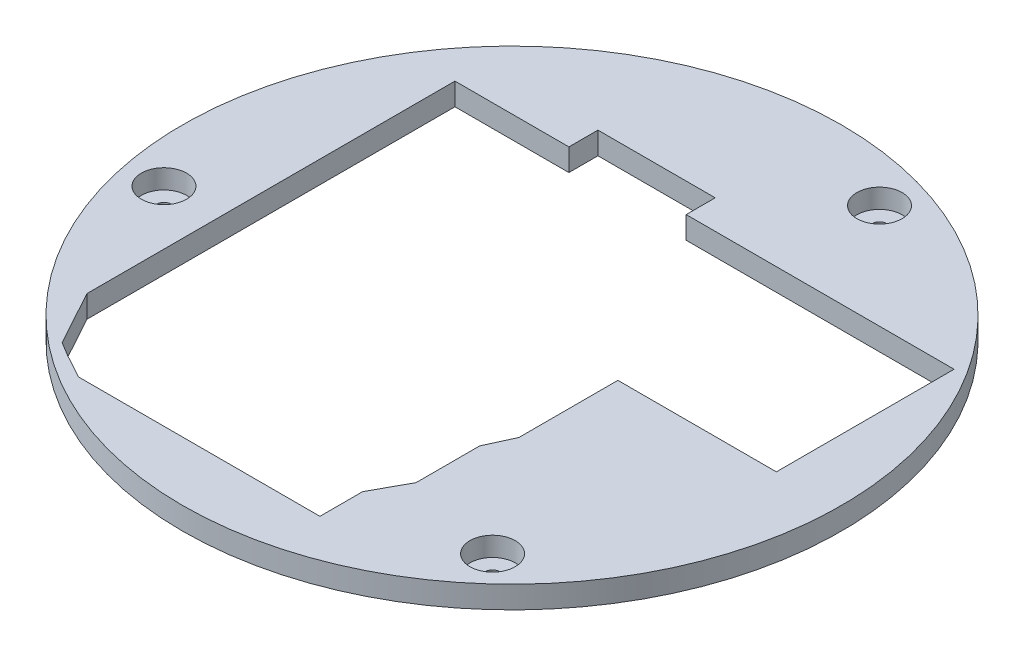
ISO-10303-21;
HEADER;
FILE_DESCRIPTION(('STEP AP214'),'2;1');
FILE_NAME('part.step','',(''),(''),'','','');
FILE_SCHEMA(('AUTOMOTIVE_DESIGN { 1 0 10303 214 1 1 1 1 }'));
ENDSEC;
DATA;
#1=APPLICATION_CONTEXT('core data for automotive mechanical design processes');
#2=APPLICATION_PROTOCOL_DEFINITION('international standard','automotive_design',2000,#1);
#3=PRODUCT_CONTEXT('',#1,'mechanical');
#4=PRODUCT('Part','Part','',(#3));
#5=PRODUCT_RELATED_PRODUCT_CATEGORY('part','',(#4));
#6=PRODUCT_DEFINITION_FORMATION('','',#4);
#7=PRODUCT_DEFINITION_CONTEXT('part definition',#1,'design');
#8=PRODUCT_DEFINITION('design','',#6,#7);
#9=PRODUCT_DEFINITION_SHAPE('','',#8);
#10=(LENGTH_UNIT() NAMED_UNIT(*) SI_UNIT(.MILLI.,.METRE.));
#11=(NAMED_UNIT(*) PLANE_ANGLE_UNIT() SI_UNIT($,.RADIAN.));
#12=(NAMED_UNIT(*) SI_UNIT($,.STERADIAN.) SOLID_ANGLE_UNIT());
#13=UNCERTAINTY_MEASURE_WITH_UNIT(LENGTH_MEASURE(1.E-05),#10,'distance_accuracy_value','');
#14=(GEOMETRIC_REPRESENTATION_CONTEXT(3) GLOBAL_UNCERTAINTY_ASSIGNED_CONTEXT((#13)) GLOBAL_UNIT_ASSIGNED_CONTEXT((#10,
#11,#12)) REPRESENTATION_CONTEXT('',''));
#15=CARTESIAN_POINT('',(0.,0.,0.));
#16=DIRECTION('',(0.,0.,1.));
#17=DIRECTION('',(1.,0.,0.));
#18=AXIS2_PLACEMENT_3D('',#15,#16,#17);
#19=CARTESIAN_POINT('',(5.84466803456712,3.,0.));
#20=DIRECTION('',(0.,1.,0.));
#21=DIRECTION('',(0.,0.,1.));
#22=AXIS2_PLACEMENT_3D('',#19,#20,#21);
#23=PLANE('',#22);
#24=CARTESIAN_POINT('',(17.8189250962218,3.,-37.5363446251951));
#25=DIRECTION('',(0.,1.,0.));
#26=DIRECTION('',(0.,0.,1.));
#27=AXIS2_PLACEMENT_3D('',#24,#25,#26);
#28=CIRCLE('',#27,3.05);
#29=CARTESIAN_POINT('',(17.8189250962218,3.,-34.4863446251951));
#30=VERTEX_POINT('',#29);
#31=EDGE_CURVE('E764',#30,#30,#28,.T.);
#32=ORIENTED_EDGE('',*,*,#31,.F.);
#33=EDGE_LOOP('',(#32));
#34=FACE_BOUND('',#33,.T.);
#35=CARTESIAN_POINT('',(32.3649675143661,3.,29.1381831194358));
#36=DIRECTION('',(0.,1.,0.));
#37=DIRECTION('',(0.,0.,1.));
#38=AXIS2_PLACEMENT_3D('',#35,#36,#37);
#39=CIRCLE('',#38,3.05);
#40=CARTESIAN_POINT('',(32.3649675143661,3.,32.1881831194358));
#41=VERTEX_POINT('',#40);
#42=EDGE_CURVE('E768',#41,#41,#39,.T.);
#43=ORIENTED_EDGE('',*,*,#42,.F.);
#44=EDGE_LOOP('',(#43));
#45=FACE_BOUND('',#44,.T.);
#46=CARTESIAN_POINT('',(-32.6498885068867,3.,8.39816150575934));
#47=DIRECTION('',(0.,1.,0.));
#48=DIRECTION('',(0.,0.,1.));
#49=AXIS2_PLACEMENT_3D('',#46,#47,#48);
#50=CIRCLE('',#49,3.05);
#51=CARTESIAN_POINT('',(-32.6498885068867,3.,11.4481615057593));
#52=VERTEX_POINT('',#51);
#53=EDGE_CURVE('E776',#52,#52,#50,.T.);
#54=ORIENTED_EDGE('',*,*,#53,.F.);
#55=EDGE_LOOP('',(#54));
#56=FACE_BOUND('',#55,.T.);
#57=CARTESIAN_POINT('',(5.84466803456712,3.,0.));
#58=DIRECTION('',(0.,1.,0.));
#59=DIRECTION('',(0.,0.,1.));
#60=AXIS2_PLACEMENT_3D('',#57,#58,#59);
#61=CIRCLE('',#60,44.4);
#62=CARTESIAN_POINT('',(5.84466803456712,3.,44.4));
#63=VERTEX_POINT('',#62);
#64=EDGE_CURVE('E11',#63,#63,#61,.T.);
#65=ORIENTED_EDGE('',*,*,#64,.T.);
#66=EDGE_LOOP('',(#65));
#67=FACE_BOUND('',#66,.T.);
#68=DIRECTION('',(1.,0.,0.));
#69=VECTOR('',#68,1.);
#70=CARTESIAN_POINT('',(20.5826988650348,3.,0.473949831188909));
#71=LINE('',#70,#69);
#72=CARTESIAN_POINT('',(20.5826988650348,3.,0.473949831188909));
#73=VERTEX_POINT('',#72);
#74=CARTESIAN_POINT('',(41.9367601675083,3.,0.473949831188909));
#75=VERTEX_POINT('',#74);
#76=EDGE_CURVE('E171',#73,#75,#71,.T.);
#77=ORIENTED_EDGE('',*,*,#76,.F.);
#78=DIRECTION('',(0.,0.,-1.));
#79=VECTOR('',#78,1.);
#80=CARTESIAN_POINT('',(20.5826988650348,3.,13.8176327506295));
#81=LINE('',#80,#79);
#82=CARTESIAN_POINT('',(20.5826988650348,3.,13.8176327506295));
#83=VERTEX_POINT('',#82);
#84=EDGE_CURVE('E162',#83,#73,#81,.T.);
#85=ORIENTED_EDGE('',*,*,#84,.F.);
#86=DIRECTION('',(0.417167660330648,0.,-0.908829545720348));
#87=VECTOR('',#86,1.);
#88=CARTESIAN_POINT('',(20.5826988650348,3.,13.8176327506295));
#89=LINE('',#88,#87);
#90=CARTESIAN_POINT('',(18.9229299742187,3.,17.4335578341931));
#91=VERTEX_POINT('',#90);
#92=EDGE_CURVE('E230',#91,#83,#89,.T.);
#93=ORIENTED_EDGE('',*,*,#92,.F.);
#94=DIRECTION('',(0.,0.,-1.));
#95=VECTOR('',#94,1.);
#96=CARTESIAN_POINT('',(18.9229299742187,3.,17.4335578341931));
#97=LINE('',#96,#95);
#98=CARTESIAN_POINT('',(18.9229299742187,3.,26.0130519167125));
#99=VERTEX_POINT('',#98);
#100=EDGE_CURVE('E227',#99,#91,#97,.T.);
#101=ORIENTED_EDGE('',*,*,#100,.F.);
#102=DIRECTION('',(0.481347502896072,0.,-0.876529852004891));
#103=VECTOR('',#102,1.);
#104=CARTESIAN_POINT('',(18.9229299742187,3.,26.0130519167125));
#105=LINE('',#104,#103);
#106=CARTESIAN_POINT('',(16.3766745031255,3.,30.6497622306037));
#107=VERTEX_POINT('',#106);
#108=EDGE_CURVE('E224',#107,#99,#105,.T.);
#109=ORIENTED_EDGE('',*,*,#108,.F.);
#110=DIRECTION('',(0.,0.,-1.));
#111=VECTOR('',#110,1.);
#112=CARTESIAN_POINT('',(16.3766745031255,3.,30.6497622306037));
#113=LINE('',#112,#111);
#114=CARTESIAN_POINT('',(16.3766745031255,3.,36.4090445152276));
#115=VERTEX_POINT('',#114);
#116=EDGE_CURVE('E221',#115,#107,#113,.T.);
#117=ORIENTED_EDGE('',*,*,#116,.F.);
#118=DIRECTION('',(1.,0.,0.));
#119=VECTOR('',#118,1.);
#120=CARTESIAN_POINT('',(16.3766745031255,3.,36.4090445152276));
#121=LINE('',#120,#119);
#122=CARTESIAN_POINT('',(-16.1675590285399,3.,36.4090445152276));
#123=VERTEX_POINT('',#122);
#124=EDGE_CURVE('E218',#123,#115,#121,.T.);
#125=ORIENTED_EDGE('',*,*,#124,.F.);
#126=DIRECTION('',(0.876529852004891,0.,0.481347502896073));
#127=VECTOR('',#126,1.);
#128=CARTESIAN_POINT('',(-16.1675590285399,3.,36.4090445152276));
#129=LINE('',#128,#127);
#130=CARTESIAN_POINT('',(-19.4141499461729,3.,34.6261749100986));
#131=VERTEX_POINT('',#130);
#132=EDGE_CURVE('E215',#131,#123,#129,.T.);
#133=ORIENTED_EDGE('',*,*,#132,.F.);
#134=DIRECTION('',(0.855404126938537,0.,0.517961175781081));
#135=VECTOR('',#134,1.);
#136=CARTESIAN_POINT('',(-21.2617129300591,3.,33.507445335005));
#137=LINE('',#136,#135);
#138=CARTESIAN_POINT('',(-21.2617129300591,3.,33.507445335005));
#139=VERTEX_POINT('',#138);
#140=EDGE_CURVE('E212',#139,#131,#137,.T.);
#141=ORIENTED_EDGE('',*,*,#140,.F.);
#142=DIRECTION('',(0.479795357210963,0.,0.877380427863994));
#143=VECTOR('',#142,1.);
#144=CARTESIAN_POINT('',(-22.6865778769418,3.,30.9018581863267));
#145=LINE('',#144,#143);
#146=CARTESIAN_POINT('',(-25.3061511928694,3.,26.1115609852243));
#147=VERTEX_POINT('',#146);
#148=EDGE_CURVE('E209',#147,#139,#145,.T.);
#149=ORIENTED_EDGE('',*,*,#148,.F.);
#150=DIRECTION('',(0.,0.,1.));
#151=VECTOR('',#150,1.);
#152=CARTESIAN_POINT('',(-25.3061511928694,3.,26.1115609852243));
#153=LINE('',#152,#151);
#154=CARTESIAN_POINT('',(-25.3061511928694,3.,-23.4664276059816));
#155=VERTEX_POINT('',#154);
#156=EDGE_CURVE('E206',#155,#147,#153,.T.);
#157=ORIENTED_EDGE('',*,*,#156,.F.);
#158=DIRECTION('',(-1.,0.,0.));
#159=VECTOR('',#158,1.);
#160=CARTESIAN_POINT('',(-25.3061511928694,3.,-23.4664276059816));
#161=LINE('',#160,#159);
#162=CARTESIAN_POINT('',(-9.95647215326252,3.,-23.4664276059816));
#163=VERTEX_POINT('',#162);
#164=EDGE_CURVE('E203',#163,#155,#161,.T.);
#165=ORIENTED_EDGE('',*,*,#164,.F.);
#166=DIRECTION('',(1.23697802389945E-13,0.,1.));
#167=VECTOR('',#166,1.);
#168=CARTESIAN_POINT('',(-9.95647215326252,3.,-23.4664276059816));
#169=LINE('',#168,#167);
#170=CARTESIAN_POINT('',(-9.956472153263,3.,-27.3790908905871));
#171=VERTEX_POINT('',#170);
#172=EDGE_CURVE('E200',#171,#163,#169,.T.);
#173=ORIENTED_EDGE('',*,*,#172,.F.);
#174=DIRECTION('',(-1.,0.,0.));
#175=VECTOR('',#174,1.);
#176=CARTESIAN_POINT('',(-9.956472153263,3.,-27.3790908905871));
#177=LINE('',#176,#175);
#178=CARTESIAN_POINT('',(5.84466803457294,3.,-27.3790908905871));
#179=VERTEX_POINT('',#178);
#180=EDGE_CURVE('E197',#179,#171,#177,.T.);
#181=ORIENTED_EDGE('',*,*,#180,.F.);
#182=DIRECTION('',(0.,0.,-1.));
#183=VECTOR('',#182,1.);
#184=CARTESIAN_POINT('',(5.84466803457294,3.,-27.3790908905871));
#185=LINE('',#184,#183);
#186=CARTESIAN_POINT('',(5.84466803457294,3.,-23.4664276059816));
#187=VERTEX_POINT('',#186);
#188=EDGE_CURVE('E194',#187,#179,#185,.T.);
#189=ORIENTED_EDGE('',*,*,#188,.F.);
#190=DIRECTION('',(-1.,0.,0.));
#191=VECTOR('',#190,1.);
#192=CARTESIAN_POINT('',(5.84466803457294,3.,-23.4664276059816));
#193=LINE('',#192,#191);
#194=CARTESIAN_POINT('',(41.9367601675083,3.,-23.4664276059816));
#195=VERTEX_POINT('',#194);
#196=EDGE_CURVE('E188',#195,#187,#193,.T.);
#197=ORIENTED_EDGE('',*,*,#196,.F.);
#198=DIRECTION('',(0.,0.,-1.));
#199=VECTOR('',#198,1.);
#200=CARTESIAN_POINT('',(41.9367601675083,3.,-23.4664276059816));
#201=LINE('',#200,#199);
#202=EDGE_CURVE('E184',#75,#195,#201,.T.);
#203=ORIENTED_EDGE('',*,*,#202,.F.);
#204=EDGE_LOOP('',(#77,#85,#93,#101,#109,#117,#125,#133,#141,#149,#157,#165,#173,#181,#189,#197,#203));
#205=FACE_BOUND('',#204,.T.);
#206=ADVANCED_FACE('F42',(#34,#45,#56,#67,#205),#23,.T.);
#207=CARTESIAN_POINT('',(5.84466803456712,0.,0.));
#208=DIRECTION('',(0.,1.,0.));
#209=DIRECTION('',(0.,0.,1.));
#210=AXIS2_PLACEMENT_3D('',#207,#208,#209);
#211=PLANE('',#210);
#212=CARTESIAN_POINT('',(-32.6498885068867,0.,8.39816150575934));
#213=DIRECTION('',(0.,1.,0.));
#214=DIRECTION('',(0.,0.,1.));
#215=AXIS2_PLACEMENT_3D('',#212,#213,#214);
#216=CIRCLE('',#215,0.999999999999998);
#217=CARTESIAN_POINT('',(-32.6498885068867,0.,9.39816150575934));
#218=VERTEX_POINT('',#217);
#219=EDGE_CURVE('E735',#218,#218,#216,.T.);
#220=ORIENTED_EDGE('',*,*,#219,.T.);
#221=EDGE_LOOP('',(#220));
#222=FACE_BOUND('',#221,.T.);
#223=CARTESIAN_POINT('',(17.8189250962218,0.,-37.5363446251951));
#224=DIRECTION('',(0.,1.,0.));
#225=DIRECTION('',(0.,0.,1.));
#226=AXIS2_PLACEMENT_3D('',#223,#224,#225);
#227=CIRCLE('',#226,1.);
#228=CARTESIAN_POINT('',(17.8189250962218,0.,-36.5363446251951));
#229=VERTEX_POINT('',#228);
#230=EDGE_CURVE('E747',#229,#229,#227,.T.);
#231=ORIENTED_EDGE('',*,*,#230,.T.);
#232=EDGE_LOOP('',(#231));
#233=FACE_BOUND('',#232,.T.);
#234=CARTESIAN_POINT('',(32.3649675143661,0.,29.1381831194358));
#235=DIRECTION('',(0.,1.,0.));
#236=DIRECTION('',(0.,0.,1.));
#237=AXIS2_PLACEMENT_3D('',#234,#235,#236);
#238=CIRCLE('',#237,0.999999999999998);
#239=CARTESIAN_POINT('',(32.3649675143661,0.,30.1381831194358));
#240=VERTEX_POINT('',#239);
#241=EDGE_CURVE('E757',#240,#240,#238,.T.);
#242=ORIENTED_EDGE('',*,*,#241,.T.);
#243=EDGE_LOOP('',(#242));
#244=FACE_BOUND('',#243,.T.);
#245=CARTESIAN_POINT('',(5.84466803456712,0.,0.));
#246=DIRECTION('',(0.,1.,0.));
#247=DIRECTION('',(0.,0.,1.));
#248=AXIS2_PLACEMENT_3D('',#245,#246,#247);
#249=CIRCLE('',#248,44.4);
#250=CARTESIAN_POINT('',(5.84466803456712,0.,44.4));
#251=VERTEX_POINT('',#250);
#252=EDGE_CURVE('E46',#251,#251,#249,.T.);
#253=ORIENTED_EDGE('',*,*,#252,.F.);
#254=EDGE_LOOP('',(#253));
#255=FACE_BOUND('',#254,.T.);
#256=DIRECTION('',(0.,0.,-1.));
#257=VECTOR('',#256,1.);
#258=CARTESIAN_POINT('',(20.5826988650348,0.,13.8176327506295));
#259=LINE('',#258,#257);
#260=CARTESIAN_POINT('',(20.5826988650348,0.,13.8176327506295));
#261=VERTEX_POINT('',#260);
#262=CARTESIAN_POINT('',(20.5826988650348,0.,0.473949831188909));
#263=VERTEX_POINT('',#262);
#264=EDGE_CURVE('E66',#261,#263,#259,.T.);
#265=ORIENTED_EDGE('',*,*,#264,.T.);
#266=DIRECTION('',(1.,0.,0.));
#267=VECTOR('',#266,1.);
#268=CARTESIAN_POINT('',(20.5826988650348,0.,0.473949831188909));
#269=LINE('',#268,#267);
#270=CARTESIAN_POINT('',(41.9367601675083,0.,0.473949831188909));
#271=VERTEX_POINT('',#270);
#272=EDGE_CURVE('E178',#263,#271,#269,.T.);
#273=ORIENTED_EDGE('',*,*,#272,.T.);
#274=DIRECTION('',(0.,0.,-1.));
#275=VECTOR('',#274,1.);
#276=CARTESIAN_POINT('',(41.9367601675083,0.,-23.4664276059816));
#277=LINE('',#276,#275);
#278=CARTESIAN_POINT('',(41.9367601675083,0.,-23.4664276059816));
#279=VERTEX_POINT('',#278);
#280=EDGE_CURVE('E238',#271,#279,#277,.T.);
#281=ORIENTED_EDGE('',*,*,#280,.T.);
#282=DIRECTION('',(-1.,0.,0.));
#283=VECTOR('',#282,1.);
#284=CARTESIAN_POINT('',(5.84466803457294,0.,-23.4664276059816));
#285=LINE('',#284,#283);
#286=CARTESIAN_POINT('',(5.84466803457294,0.,-23.4664276059816));
#287=VERTEX_POINT('',#286);
#288=EDGE_CURVE('E242',#279,#287,#285,.T.);
#289=ORIENTED_EDGE('',*,*,#288,.T.);
#290=DIRECTION('',(0.,0.,-1.));
#291=VECTOR('',#290,1.);
#292=CARTESIAN_POINT('',(5.84466803457294,0.,-27.3790908905871));
#293=LINE('',#292,#291);
#294=CARTESIAN_POINT('',(5.84466803457294,0.,-27.3790908905871));
#295=VERTEX_POINT('',#294);
#296=EDGE_CURVE('E246',#287,#295,#293,.T.);
#297=ORIENTED_EDGE('',*,*,#296,.T.);
#298=DIRECTION('',(-1.,0.,0.));
#299=VECTOR('',#298,1.);
#300=CARTESIAN_POINT('',(-9.956472153263,0.,-27.3790908905871));
#301=LINE('',#300,#299);
#302=CARTESIAN_POINT('',(-9.956472153263,0.,-27.3790908905871));
#303=VERTEX_POINT('',#302);
#304=EDGE_CURVE('E250',#295,#303,#301,.T.);
#305=ORIENTED_EDGE('',*,*,#304,.T.);
#306=DIRECTION('',(1.23697802389945E-13,0.,1.));
#307=VECTOR('',#306,1.);
#308=CARTESIAN_POINT('',(-9.95647215326252,0.,-23.4664276059816));
#309=LINE('',#308,#307);
#310=CARTESIAN_POINT('',(-9.95647215326252,0.,-23.4664276059816));
#311=VERTEX_POINT('',#310);
#312=EDGE_CURVE('E254',#303,#311,#309,.T.);
#313=ORIENTED_EDGE('',*,*,#312,.T.);
#314=DIRECTION('',(-1.,0.,0.));
#315=VECTOR('',#314,1.);
#316=CARTESIAN_POINT('',(-25.3061511928694,0.,-23.4664276059816));
#317=LINE('',#316,#315);
#318=CARTESIAN_POINT('',(-25.3061511928694,0.,-23.4664276059816));
#319=VERTEX_POINT('',#318);
#320=EDGE_CURVE('E258',#311,#319,#317,.T.);
#321=ORIENTED_EDGE('',*,*,#320,.T.);
#322=DIRECTION('',(0.,0.,1.));
#323=VECTOR('',#322,1.);
#324=CARTESIAN_POINT('',(-25.3061511928694,0.,26.1115609852243));
#325=LINE('',#324,#323);
#326=CARTESIAN_POINT('',(-25.3061511928694,0.,26.1115609852243));
#327=VERTEX_POINT('',#326);
#328=EDGE_CURVE('E262',#319,#327,#325,.T.);
#329=ORIENTED_EDGE('',*,*,#328,.T.);
#330=DIRECTION('',(0.479795357210963,0.,0.877380427863993));
#331=VECTOR('',#330,1.);
#332=CARTESIAN_POINT('',(-22.6865778769418,0.,30.9018581863267));
#333=LINE('',#332,#331);
#334=CARTESIAN_POINT('',(-21.2617129300591,0.,33.507445335005));
#335=VERTEX_POINT('',#334);
#336=EDGE_CURVE('E266',#327,#335,#333,.T.);
#337=ORIENTED_EDGE('',*,*,#336,.T.);
#338=DIRECTION('',(0.855404126938537,0.,0.517961175781081));
#339=VECTOR('',#338,1.);
#340=CARTESIAN_POINT('',(-21.2617129300591,0.,33.507445335005));
#341=LINE('',#340,#339);
#342=CARTESIAN_POINT('',(-19.4141499461729,0.,34.6261749100986));
#343=VERTEX_POINT('',#342);
#344=EDGE_CURVE('E270',#335,#343,#341,.T.);
#345=ORIENTED_EDGE('',*,*,#344,.T.);
#346=DIRECTION('',(0.876529852004891,0.,0.481347502896073));
#347=VECTOR('',#346,1.);
#348=CARTESIAN_POINT('',(-16.1675590285399,0.,36.4090445152276));
#349=LINE('',#348,#347);
#350=CARTESIAN_POINT('',(-16.1675590285399,0.,36.4090445152276));
#351=VERTEX_POINT('',#350);
#352=EDGE_CURVE('E274',#343,#351,#349,.T.);
#353=ORIENTED_EDGE('',*,*,#352,.T.);
#354=DIRECTION('',(1.,0.,0.));
#355=VECTOR('',#354,1.);
#356=CARTESIAN_POINT('',(16.3766745031255,0.,36.4090445152276));
#357=LINE('',#356,#355);
#358=CARTESIAN_POINT('',(16.3766745031255,0.,36.4090445152276));
#359=VERTEX_POINT('',#358);
#360=EDGE_CURVE('E278',#351,#359,#357,.T.);
#361=ORIENTED_EDGE('',*,*,#360,.T.);
#362=DIRECTION('',(0.,0.,-1.));
#363=VECTOR('',#362,1.);
#364=CARTESIAN_POINT('',(16.3766745031255,0.,30.6497622306037));
#365=LINE('',#364,#363);
#366=CARTESIAN_POINT('',(16.3766745031255,0.,30.6497622306037));
#367=VERTEX_POINT('',#366);
#368=EDGE_CURVE('E282',#359,#367,#365,.T.);
#369=ORIENTED_EDGE('',*,*,#368,.T.);
#370=DIRECTION('',(0.481347502896072,0.,-0.876529852004891));
#371=VECTOR('',#370,1.);
#372=CARTESIAN_POINT('',(18.9229299742187,0.,26.0130519167125));
#373=LINE('',#372,#371);
#374=CARTESIAN_POINT('',(18.9229299742187,0.,26.0130519167125));
#375=VERTEX_POINT('',#374);
#376=EDGE_CURVE('E286',#367,#375,#373,.T.);
#377=ORIENTED_EDGE('',*,*,#376,.T.);
#378=DIRECTION('',(0.,0.,-1.));
#379=VECTOR('',#378,1.);
#380=CARTESIAN_POINT('',(18.9229299742187,0.,17.4335578341931));
#381=LINE('',#380,#379);
#382=CARTESIAN_POINT('',(18.9229299742187,0.,17.4335578341931));
#383=VERTEX_POINT('',#382);
#384=EDGE_CURVE('E290',#375,#383,#381,.T.);
#385=ORIENTED_EDGE('',*,*,#384,.T.);
#386=DIRECTION('',(0.417167660330648,0.,-0.908829545720348));
#387=VECTOR('',#386,1.);
#388=CARTESIAN_POINT('',(20.5826988650348,0.,13.8176327506295));
#389=LINE('',#388,#387);
#390=EDGE_CURVE('E172',#383,#261,#389,.T.);
#391=ORIENTED_EDGE('',*,*,#390,.T.);
#392=EDGE_LOOP('',(#265,#273,#281,#289,#297,#305,#313,#321,#329,#337,#345,#353,#361,#369,#377,
#385,#391));
#393=FACE_BOUND('',#392,.T.);
#394=ADVANCED_FACE('F348',(#222,#233,#244,#255,#393),#211,.F.);
#395=CARTESIAN_POINT('',(5.84466803456712,3.,0.));
#396=DIRECTION('',(0.,-1.,0.));
#397=DIRECTION('',(0.,0.,-1.));
#398=AXIS2_PLACEMENT_3D('',#395,#396,#397);
#399=CYLINDRICAL_SURFACE('',#398,44.4);
#400=ORIENTED_EDGE('',*,*,#64,.F.);
#401=EDGE_LOOP('',(#400));
#402=FACE_BOUND('',#401,.T.);
#403=ORIENTED_EDGE('',*,*,#252,.T.);
#404=EDGE_LOOP('',(#403));
#405=FACE_BOUND('',#404,.T.);
#406=ADVANCED_FACE('F44',(#402,#405),#399,.T.);
#407=CARTESIAN_POINT('',(20.5826988650348,3.,13.8176327506295));
#408=DIRECTION('',(-1.,0.,0.));
#409=DIRECTION('',(0.,0.,1.));
#410=AXIS2_PLACEMENT_3D('',#407,#408,#409);
#411=PLANE('',#410);
#412=ORIENTED_EDGE('',*,*,#264,.F.);
#413=DIRECTION('',(0.,-1.,0.));
#414=VECTOR('',#413,1.);
#415=CARTESIAN_POINT('',(20.5826988650348,3.,13.8176327506295));
#416=LINE('',#415,#414);
#417=EDGE_CURVE('E166',#83,#261,#416,.T.);
#418=ORIENTED_EDGE('',*,*,#417,.F.);
#419=ORIENTED_EDGE('',*,*,#84,.T.);
#420=DIRECTION('',(0.,-1.,0.));
#421=VECTOR('',#420,1.);
#422=CARTESIAN_POINT('',(20.5826988650348,3.,0.473949831188909));
#423=LINE('',#422,#421);
#424=EDGE_CURVE('E165',#73,#263,#423,.T.);
#425=ORIENTED_EDGE('',*,*,#424,.T.);
#426=EDGE_LOOP('',(#412,#418,#419,#425));
#427=FACE_BOUND('',#426,.T.);
#428=ADVANCED_FACE('F164',(#427),#411,.T.);
#429=CARTESIAN_POINT('',(20.5826988650348,3.,0.473949831188909));
#430=DIRECTION('',(0.,0.,-1.));
#431=DIRECTION('',(-1.,0.,0.));
#432=AXIS2_PLACEMENT_3D('',#429,#430,#431);
#433=PLANE('',#432);
#434=ORIENTED_EDGE('',*,*,#272,.F.);
#435=ORIENTED_EDGE('',*,*,#424,.F.);
#436=ORIENTED_EDGE('',*,*,#76,.T.);
#437=DIRECTION('',(0.,-1.,0.));
#438=VECTOR('',#437,1.);
#439=CARTESIAN_POINT('',(41.9367601675083,3.,0.473949831188909));
#440=LINE('',#439,#438);
#441=EDGE_CURVE('E180',#75,#271,#440,.T.);
#442=ORIENTED_EDGE('',*,*,#441,.T.);
#443=EDGE_LOOP('',(#434,#435,#436,#442));
#444=FACE_BOUND('',#443,.T.);
#445=ADVANCED_FACE('F175',(#444),#433,.T.);
#446=CARTESIAN_POINT('',(41.9367601675083,3.,-23.4664276059816));
#447=DIRECTION('',(-1.,0.,0.));
#448=DIRECTION('',(0.,0.,1.));
#449=AXIS2_PLACEMENT_3D('',#446,#447,#448);
#450=PLANE('',#449);
#451=ORIENTED_EDGE('',*,*,#280,.F.);
#452=ORIENTED_EDGE('',*,*,#441,.F.);
#453=ORIENTED_EDGE('',*,*,#202,.T.);
#454=DIRECTION('',(0.,-1.,0.));
#455=VECTOR('',#454,1.);
#456=CARTESIAN_POINT('',(41.9367601675083,3.,-23.4664276059816));
#457=LINE('',#456,#455);
#458=EDGE_CURVE('E338',#195,#279,#457,.T.);
#459=ORIENTED_EDGE('',*,*,#458,.T.);
#460=EDGE_LOOP('',(#451,#452,#453,#459));
#461=FACE_BOUND('',#460,.T.);
#462=ADVANCED_FACE('F344',(#461),#450,.T.);
#463=CARTESIAN_POINT('',(5.84466803457294,3.,-23.4664276059816));
#464=DIRECTION('',(0.,0.,1.));
#465=DIRECTION('',(1.,0.,0.));
#466=AXIS2_PLACEMENT_3D('',#463,#464,#465);
#467=PLANE('',#466);
#468=ORIENTED_EDGE('',*,*,#288,.F.);
#469=ORIENTED_EDGE('',*,*,#458,.F.);
#470=ORIENTED_EDGE('',*,*,#196,.T.);
#471=DIRECTION('',(0.,-1.,0.));
#472=VECTOR('',#471,1.);
#473=CARTESIAN_POINT('',(5.84466803457294,3.,-23.4664276059816));
#474=LINE('',#473,#472);
#475=EDGE_CURVE('E335',#187,#287,#474,.T.);
#476=ORIENTED_EDGE('',*,*,#475,.T.);
#477=EDGE_LOOP('',(#468,#469,#470,#476));
#478=FACE_BOUND('',#477,.T.);
#479=ADVANCED_FACE('F410',(#478),#467,.T.);
#480=CARTESIAN_POINT('',(5.84466803457294,3.,-27.3790908905871));
#481=DIRECTION('',(-1.,0.,0.));
#482=DIRECTION('',(0.,0.,1.));
#483=AXIS2_PLACEMENT_3D('',#480,#481,#482);
#484=PLANE('',#483);
#485=ORIENTED_EDGE('',*,*,#296,.F.);
#486=ORIENTED_EDGE('',*,*,#475,.F.);
#487=ORIENTED_EDGE('',*,*,#188,.T.);
#488=DIRECTION('',(0.,-1.,0.));
#489=VECTOR('',#488,1.);
#490=CARTESIAN_POINT('',(5.84466803457294,3.,-27.3790908905871));
#491=LINE('',#490,#489);
#492=EDGE_CURVE('E332',#179,#295,#491,.T.);
#493=ORIENTED_EDGE('',*,*,#492,.T.);
#494=EDGE_LOOP('',(#485,#486,#487,#493));
#495=FACE_BOUND('',#494,.T.);
#496=ADVANCED_FACE('F407',(#495),#484,.T.);
#497=CARTESIAN_POINT('',(-9.956472153263,3.,-27.3790908905871));
#498=DIRECTION('',(0.,0.,1.));
#499=DIRECTION('',(1.,0.,0.));
#500=AXIS2_PLACEMENT_3D('',#497,#498,#499);
#501=PLANE('',#500);
#502=ORIENTED_EDGE('',*,*,#304,.F.);
#503=ORIENTED_EDGE('',*,*,#492,.F.);
#504=ORIENTED_EDGE('',*,*,#180,.T.);
#505=DIRECTION('',(0.,-1.,0.));
#506=VECTOR('',#505,1.);
#507=CARTESIAN_POINT('',(-9.956472153263,3.,-27.3790908905871));
#508=LINE('',#507,#506);
#509=EDGE_CURVE('E329',#171,#303,#508,.T.);
#510=ORIENTED_EDGE('',*,*,#509,.T.);
#511=EDGE_LOOP('',(#502,#503,#504,#510));
#512=FACE_BOUND('',#511,.T.);
#513=ADVANCED_FACE('F403',(#512),#501,.T.);
#514=CARTESIAN_POINT('',(-9.95647215326252,3.,-23.4664276059816));
#515=DIRECTION('',(1.,0.,-1.23697802389945E-13));
#516=DIRECTION('',(-1.23697802389945E-13,0.,-1.));
#517=AXIS2_PLACEMENT_3D('',#514,#515,#516);
#518=PLANE('',#517);
#519=ORIENTED_EDGE('',*,*,#312,.F.);
#520=ORIENTED_EDGE('',*,*,#509,.F.);
#521=ORIENTED_EDGE('',*,*,#172,.T.);
#522=DIRECTION('',(0.,-1.,0.));
#523=VECTOR('',#522,1.);
#524=CARTESIAN_POINT('',(-9.95647215326252,3.,-23.4664276059816));
#525=LINE('',#524,#523);
#526=EDGE_CURVE('E326',#163,#311,#525,.T.);
#527=ORIENTED_EDGE('',*,*,#526,.T.);
#528=EDGE_LOOP('',(#519,#520,#521,#527));
#529=FACE_BOUND('',#528,.T.);
#530=ADVANCED_FACE('F400',(#529),#518,.T.);
#531=CARTESIAN_POINT('',(-25.3061511928694,3.,-23.4664276059816));
#532=DIRECTION('',(0.,0.,1.));
#533=DIRECTION('',(1.,0.,0.));
#534=AXIS2_PLACEMENT_3D('',#531,#532,#533);
#535=PLANE('',#534);
#536=ORIENTED_EDGE('',*,*,#320,.F.);
#537=ORIENTED_EDGE('',*,*,#526,.F.);
#538=ORIENTED_EDGE('',*,*,#164,.T.);
#539=DIRECTION('',(0.,-1.,0.));
#540=VECTOR('',#539,1.);
#541=CARTESIAN_POINT('',(-25.3061511928694,3.,-23.4664276059816));
#542=LINE('',#541,#540);
#543=EDGE_CURVE('E323',#155,#319,#542,.T.);
#544=ORIENTED_EDGE('',*,*,#543,.T.);
#545=EDGE_LOOP('',(#536,#537,#538,#544));
#546=FACE_BOUND('',#545,.T.);
#547=ADVANCED_FACE('F394',(#546),#535,.T.);
#548=CARTESIAN_POINT('',(-25.3061511928694,3.,26.1115609852243));
#549=DIRECTION('',(1.,0.,0.));
#550=DIRECTION('',(0.,0.,-1.));
#551=AXIS2_PLACEMENT_3D('',#548,#549,#550);
#552=PLANE('',#551);
#553=ORIENTED_EDGE('',*,*,#328,.F.);
#554=ORIENTED_EDGE('',*,*,#543,.F.);
#555=ORIENTED_EDGE('',*,*,#156,.T.);
#556=DIRECTION('',(0.,-1.,0.));
#557=VECTOR('',#556,1.);
#558=CARTESIAN_POINT('',(-25.3061511928694,3.,26.1115609852243));
#559=LINE('',#558,#557);
#560=EDGE_CURVE('E319',#147,#327,#559,.T.);
#561=ORIENTED_EDGE('',*,*,#560,.T.);
#562=EDGE_LOOP('',(#553,#554,#555,#561));
#563=FACE_BOUND('',#562,.T.);
#564=ADVANCED_FACE('F388',(#563),#552,.T.);
#565=CARTESIAN_POINT('',(-22.6865778769418,3.,30.9018581863267));
#566=DIRECTION('',(0.877380427863993,0.,-0.479795357210963));
#567=DIRECTION('',(-0.479795357210963,0.,-0.877380427863994));
#568=AXIS2_PLACEMENT_3D('',#565,#566,#567);
#569=PLANE('',#568);
#570=ORIENTED_EDGE('',*,*,#336,.F.);
#571=ORIENTED_EDGE('',*,*,#560,.F.);
#572=ORIENTED_EDGE('',*,*,#148,.T.);
#573=DIRECTION('',(0.,-1.,0.));
#574=VECTOR('',#573,1.);
#575=CARTESIAN_POINT('',(-21.2617129300591,3.,33.507445335005));
#576=LINE('',#575,#574);
#577=EDGE_CURVE('E316',#139,#335,#576,.T.);
#578=ORIENTED_EDGE('',*,*,#577,.T.);
#579=EDGE_LOOP('',(#570,#571,#572,#578));
#580=FACE_BOUND('',#579,.T.);
#581=ADVANCED_FACE('F385',(#580),#569,.T.);
#582=CARTESIAN_POINT('',(-21.2617129300591,3.,33.507445335005));
#583=DIRECTION('',(0.517961175781081,0.,-0.855404126938536));
#584=DIRECTION('',(-0.855404126938537,0.,-0.517961175781081));
#585=AXIS2_PLACEMENT_3D('',#582,#583,#584);
#586=PLANE('',#585);
#587=ORIENTED_EDGE('',*,*,#344,.F.);
#588=ORIENTED_EDGE('',*,*,#577,.F.);
#589=ORIENTED_EDGE('',*,*,#140,.T.);
#590=DIRECTION('',(0.,-1.,0.));
#591=VECTOR('',#590,1.);
#592=CARTESIAN_POINT('',(-19.4141499461729,3.,34.6261749100986));
#593=LINE('',#592,#591);
#594=EDGE_CURVE('E313',#131,#343,#593,.T.);
#595=ORIENTED_EDGE('',*,*,#594,.T.);
#596=EDGE_LOOP('',(#587,#588,#589,#595));
#597=FACE_BOUND('',#596,.T.);
#598=ADVANCED_FACE('F378',(#597),#586,.T.);
#599=CARTESIAN_POINT('',(-16.1675590285399,3.,36.4090445152276));
#600=DIRECTION('',(0.481347502896073,0.,-0.87652985200489));
#601=DIRECTION('',(-0.876529852004891,0.,-0.481347502896073));
#602=AXIS2_PLACEMENT_3D('',#599,#600,#601);
#603=PLANE('',#602);
#604=ORIENTED_EDGE('',*,*,#352,.F.);
#605=ORIENTED_EDGE('',*,*,#594,.F.);
#606=ORIENTED_EDGE('',*,*,#132,.T.);
#607=DIRECTION('',(0.,-1.,0.));
#608=VECTOR('',#607,1.);
#609=CARTESIAN_POINT('',(-16.1675590285399,3.,36.4090445152276));
#610=LINE('',#609,#608);
#611=EDGE_CURVE('E310',#123,#351,#610,.T.);
#612=ORIENTED_EDGE('',*,*,#611,.T.);
#613=EDGE_LOOP('',(#604,#605,#606,#612));
#614=FACE_BOUND('',#613,.T.);
#615=ADVANCED_FACE('F374',(#614),#603,.T.);
#616=CARTESIAN_POINT('',(16.3766745031255,3.,36.4090445152276));
#617=DIRECTION('',(0.,0.,-1.));
#618=DIRECTION('',(-1.,0.,0.));
#619=AXIS2_PLACEMENT_3D('',#616,#617,#618);
#620=PLANE('',#619);
#621=ORIENTED_EDGE('',*,*,#360,.F.);
#622=ORIENTED_EDGE('',*,*,#611,.F.);
#623=ORIENTED_EDGE('',*,*,#124,.T.);
#624=DIRECTION('',(0.,-1.,0.));
#625=VECTOR('',#624,1.);
#626=CARTESIAN_POINT('',(16.3766745031255,3.,36.4090445152276));
#627=LINE('',#626,#625);
#628=EDGE_CURVE('E307',#115,#359,#627,.T.);
#629=ORIENTED_EDGE('',*,*,#628,.T.);
#630=EDGE_LOOP('',(#621,#622,#623,#629));
#631=FACE_BOUND('',#630,.T.);
#632=ADVANCED_FACE('F371',(#631),#620,.T.);
#633=CARTESIAN_POINT('',(16.3766745031255,3.,30.6497622306037));
#634=DIRECTION('',(-1.,0.,0.));
#635=DIRECTION('',(0.,0.,1.));
#636=AXIS2_PLACEMENT_3D('',#633,#634,#635);
#637=PLANE('',#636);
#638=ORIENTED_EDGE('',*,*,#368,.F.);
#639=ORIENTED_EDGE('',*,*,#628,.F.);
#640=ORIENTED_EDGE('',*,*,#116,.T.);
#641=DIRECTION('',(0.,-1.,0.));
#642=VECTOR('',#641,1.);
#643=CARTESIAN_POINT('',(16.3766745031255,3.,30.6497622306037));
#644=LINE('',#643,#642);
#645=EDGE_CURVE('E304',#107,#367,#644,.T.);
#646=ORIENTED_EDGE('',*,*,#645,.T.);
#647=EDGE_LOOP('',(#638,#639,#640,#646));
#648=FACE_BOUND('',#647,.T.);
#649=ADVANCED_FACE('F363',(#648),#637,.T.);
#650=CARTESIAN_POINT('',(18.9229299742187,3.,26.0130519167125));
#651=DIRECTION('',(-0.876529852004891,0.,-0.481347502896072));
#652=DIRECTION('',(-0.481347502896072,0.,0.876529852004891));
#653=AXIS2_PLACEMENT_3D('',#650,#651,#652);
#654=PLANE('',#653);
#655=ORIENTED_EDGE('',*,*,#376,.F.);
#656=ORIENTED_EDGE('',*,*,#645,.F.);
#657=ORIENTED_EDGE('',*,*,#108,.T.);
#658=DIRECTION('',(0.,-1.,0.));
#659=VECTOR('',#658,1.);
#660=CARTESIAN_POINT('',(18.9229299742187,3.,26.0130519167125));
#661=LINE('',#660,#659);
#662=EDGE_CURVE('E301',#99,#375,#661,.T.);
#663=ORIENTED_EDGE('',*,*,#662,.T.);
#664=EDGE_LOOP('',(#655,#656,#657,#663));
#665=FACE_BOUND('',#664,.T.);
#666=ADVANCED_FACE('F359',(#665),#654,.T.);
#667=CARTESIAN_POINT('',(18.9229299742187,3.,17.4335578341931));
#668=DIRECTION('',(-1.,0.,0.));
#669=DIRECTION('',(0.,0.,1.));
#670=AXIS2_PLACEMENT_3D('',#667,#668,#669);
#671=PLANE('',#670);
#672=ORIENTED_EDGE('',*,*,#384,.F.);
#673=ORIENTED_EDGE('',*,*,#662,.F.);
#674=ORIENTED_EDGE('',*,*,#100,.T.);
#675=DIRECTION('',(0.,-1.,0.));
#676=VECTOR('',#675,1.);
#677=CARTESIAN_POINT('',(18.9229299742187,3.,17.4335578341931));
#678=LINE('',#677,#676);
#679=EDGE_CURVE('E58',#91,#383,#678,.T.);
#680=ORIENTED_EDGE('',*,*,#679,.T.);
#681=EDGE_LOOP('',(#672,#673,#674,#680));
#682=FACE_BOUND('',#681,.T.);
#683=ADVANCED_FACE('F356',(#682),#671,.T.);
#684=CARTESIAN_POINT('',(20.5826988650348,3.,13.8176327506295));
#685=DIRECTION('',(-0.908829545720348,0.,-0.417167660330648));
#686=DIRECTION('',(-0.417167660330648,0.,0.908829545720348));
#687=AXIS2_PLACEMENT_3D('',#684,#685,#686);
#688=PLANE('',#687);
#689=ORIENTED_EDGE('',*,*,#390,.F.);
#690=ORIENTED_EDGE('',*,*,#679,.F.);
#691=ORIENTED_EDGE('',*,*,#92,.T.);
#692=ORIENTED_EDGE('',*,*,#417,.T.);
#693=EDGE_LOOP('',(#689,#690,#691,#692));
#694=FACE_BOUND('',#693,.T.);
#695=ADVANCED_FACE('F350',(#694),#688,.T.);
#696=CARTESIAN_POINT('',(-32.6498885068867,0.4,8.39816150575934));
#697=DIRECTION('',(0.,1.,0.));
#698=DIRECTION('',(0.,0.,1.));
#699=AXIS2_PLACEMENT_3D('',#696,#697,#698);
#700=CYLINDRICAL_SURFACE('',#699,3.05);
#701=CARTESIAN_POINT('',(-32.6498885068867,0.4,8.39816150575934));
#702=DIRECTION('',(0.,1.,0.));
#703=DIRECTION('',(0.,0.,1.));
#704=AXIS2_PLACEMENT_3D('',#701,#702,#703);
#705=CIRCLE('',#704,3.05);
#706=CARTESIAN_POINT('',(-32.6498885068867,0.4,11.4481615057593));
#707=VERTEX_POINT('',#706);
#708=EDGE_CURVE('E744',#707,#707,#705,.T.);
#709=ORIENTED_EDGE('',*,*,#708,.F.);
#710=EDGE_LOOP('',(#709));
#711=FACE_BOUND('',#710,.T.);
#712=ORIENTED_EDGE('',*,*,#53,.T.);
#713=EDGE_LOOP('',(#712));
#714=FACE_BOUND('',#713,.T.);
#715=ADVANCED_FACE('F561',(#711,#714),#700,.F.);
#716=CARTESIAN_POINT('',(-32.6498885068867,0.4,8.39816150575934));
#717=DIRECTION('',(0.,1.,0.));
#718=DIRECTION('',(0.,0.,1.));
#719=AXIS2_PLACEMENT_3D('',#716,#717,#718);
#720=PLANE('',#719);
#721=CARTESIAN_POINT('',(-32.6498885068867,0.4,8.39816150575934));
#722=DIRECTION('',(0.,1.,0.));
#723=DIRECTION('',(0.,0.,1.));
#724=AXIS2_PLACEMENT_3D('',#721,#722,#723);
#725=CIRCLE('',#724,0.999999999999998);
#726=CARTESIAN_POINT('',(-32.6498885068867,0.4,9.39816150575934));
#727=VERTEX_POINT('',#726);
#728=EDGE_CURVE('E738',#727,#727,#725,.T.);
#729=ORIENTED_EDGE('',*,*,#728,.F.);
#730=EDGE_LOOP('',(#729));
#731=FACE_BOUND('',#730,.T.);
#732=ORIENTED_EDGE('',*,*,#708,.T.);
#733=EDGE_LOOP('',(#732));
#734=FACE_BOUND('',#733,.T.);
#735=ADVANCED_FACE('F578',(#731,#734),#720,.T.);
#736=CARTESIAN_POINT('',(32.3649675143661,0.4,29.1381831194358));
#737=DIRECTION('',(0.,1.,0.));
#738=DIRECTION('',(0.,0.,1.));
#739=AXIS2_PLACEMENT_3D('',#736,#737,#738);
#740=CYLINDRICAL_SURFACE('',#739,3.05);
#741=CARTESIAN_POINT('',(32.3649675143661,0.4,29.1381831194358));
#742=DIRECTION('',(0.,1.,0.));
#743=DIRECTION('',(0.,0.,1.));
#744=AXIS2_PLACEMENT_3D('',#741,#742,#743);
#745=CIRCLE('',#744,3.05);
#746=CARTESIAN_POINT('',(32.3649675143661,0.4,32.1881831194358));
#747=VERTEX_POINT('',#746);
#748=EDGE_CURVE('E772',#747,#747,#745,.T.);
#749=ORIENTED_EDGE('',*,*,#748,.F.);
#750=EDGE_LOOP('',(#749));
#751=FACE_BOUND('',#750,.T.);
#752=ORIENTED_EDGE('',*,*,#42,.T.);
#753=EDGE_LOOP('',(#752));
#754=FACE_BOUND('',#753,.T.);
#755=ADVANCED_FACE('F587',(#751,#754),#740,.F.);
#756=CARTESIAN_POINT('',(32.3649675143661,0.4,29.1381831194358));
#757=DIRECTION('',(0.,1.,0.));
#758=DIRECTION('',(0.,0.,1.));
#759=AXIS2_PLACEMENT_3D('',#756,#757,#758);
#760=PLANE('',#759);
#761=CARTESIAN_POINT('',(32.3649675143661,0.4,29.1381831194358));
#762=DIRECTION('',(0.,1.,0.));
#763=DIRECTION('',(0.,0.,1.));
#764=AXIS2_PLACEMENT_3D('',#761,#762,#763);
#765=CIRCLE('',#764,0.999999999999998);
#766=CARTESIAN_POINT('',(32.3649675143661,0.4,30.1381831194358));
#767=VERTEX_POINT('',#766);
#768=EDGE_CURVE('E753',#767,#767,#765,.T.);
#769=ORIENTED_EDGE('',*,*,#768,.F.);
#770=EDGE_LOOP('',(#769));
#771=FACE_BOUND('',#770,.T.);
#772=ORIENTED_EDGE('',*,*,#748,.T.);
#773=EDGE_LOOP('',(#772));
#774=FACE_BOUND('',#773,.T.);
#775=ADVANCED_FACE('F592',(#771,#774),#760,.T.);
#776=CARTESIAN_POINT('',(17.8189250962218,0.4,-37.5363446251951));
#777=DIRECTION('',(0.,1.,0.));
#778=DIRECTION('',(0.,0.,1.));
#779=AXIS2_PLACEMENT_3D('',#776,#777,#778);
#780=CYLINDRICAL_SURFACE('',#779,3.05);
#781=CARTESIAN_POINT('',(17.8189250962218,0.4,-37.5363446251951));
#782=DIRECTION('',(0.,1.,0.));
#783=DIRECTION('',(0.,0.,1.));
#784=AXIS2_PLACEMENT_3D('',#781,#782,#783);
#785=CIRCLE('',#784,3.05);
#786=CARTESIAN_POINT('',(17.8189250962218,0.4,-34.4863446251951));
#787=VERTEX_POINT('',#786);
#788=EDGE_CURVE('E235',#787,#787,#785,.T.);
#789=ORIENTED_EDGE('',*,*,#788,.F.);
#790=EDGE_LOOP('',(#789));
#791=FACE_BOUND('',#790,.T.);
#792=ORIENTED_EDGE('',*,*,#31,.T.);
#793=EDGE_LOOP('',(#792));
#794=FACE_BOUND('',#793,.T.);
#795=ADVANCED_FACE('F601',(#791,#794),#780,.F.);
#796=CARTESIAN_POINT('',(17.8189250962218,0.4,-37.5363446251951));
#797=DIRECTION('',(0.,1.,0.));
#798=DIRECTION('',(0.,0.,1.));
#799=AXIS2_PLACEMENT_3D('',#796,#797,#798);
#800=PLANE('',#799);
#801=CARTESIAN_POINT('',(17.8189250962218,0.4,-37.5363446251951));
#802=DIRECTION('',(0.,1.,0.));
#803=DIRECTION('',(0.,0.,1.));
#804=AXIS2_PLACEMENT_3D('',#801,#802,#803);
#805=CIRCLE('',#804,1.);
#806=CARTESIAN_POINT('',(17.8189250962218,0.4,-36.5363446251951));
#807=VERTEX_POINT('',#806);
#808=EDGE_CURVE('E740',#807,#807,#805,.T.);
#809=ORIENTED_EDGE('',*,*,#808,.F.);
#810=EDGE_LOOP('',(#809));
#811=FACE_BOUND('',#810,.T.);
#812=ORIENTED_EDGE('',*,*,#788,.T.);
#813=EDGE_LOOP('',(#812));
#814=FACE_BOUND('',#813,.T.);
#815=ADVANCED_FACE('F606',(#811,#814),#800,.T.);
#816=CARTESIAN_POINT('',(32.3649675143661,0.,29.1381831194358));
#817=DIRECTION('',(0.,1.,0.));
#818=DIRECTION('',(0.,0.,1.));
#819=AXIS2_PLACEMENT_3D('',#816,#817,#818);
#820=CYLINDRICAL_SURFACE('',#819,0.999999999999998);
#821=ORIENTED_EDGE('',*,*,#241,.F.);
#822=EDGE_LOOP('',(#821));
#823=FACE_BOUND('',#822,.T.);
#824=ORIENTED_EDGE('',*,*,#768,.T.);
#825=EDGE_LOOP('',(#824));
#826=FACE_BOUND('',#825,.T.);
#827=ADVANCED_FACE('F640',(#823,#826),#820,.F.);
#828=CARTESIAN_POINT('',(17.8189250962218,0.,-37.5363446251951));
#829=DIRECTION('',(0.,1.,0.));
#830=DIRECTION('',(0.,0.,1.));
#831=AXIS2_PLACEMENT_3D('',#828,#829,#830);
#832=CYLINDRICAL_SURFACE('',#831,1.);
#833=ORIENTED_EDGE('',*,*,#230,.F.);
#834=EDGE_LOOP('',(#833));
#835=FACE_BOUND('',#834,.T.);
#836=ORIENTED_EDGE('',*,*,#808,.T.);
#837=EDGE_LOOP('',(#836));
#838=FACE_BOUND('',#837,.T.);
#839=ADVANCED_FACE('F651',(#835,#838),#832,.F.);
#840=CARTESIAN_POINT('',(-32.6498885068867,0.,8.39816150575934));
#841=DIRECTION('',(0.,1.,0.));
#842=DIRECTION('',(0.,0.,1.));
#843=AXIS2_PLACEMENT_3D('',#840,#841,#842);
#844=CYLINDRICAL_SURFACE('',#843,0.999999999999998);
#845=ORIENTED_EDGE('',*,*,#219,.F.);
#846=EDGE_LOOP('',(#845));
#847=FACE_BOUND('',#846,.T.);
#848=ORIENTED_EDGE('',*,*,#728,.T.);
#849=EDGE_LOOP('',(#848));
#850=FACE_BOUND('',#849,.T.);
#851=ADVANCED_FACE('F662',(#847,#850),#844,.F.);
#852=CLOSED_SHELL('',(#206,#394,#406,#428,#445,#462,#479,#496,#513,#530,#547,#564,#581,#598,
#615,#632,#649,#666,#683,#695,#715,#735,#755,#775,#795,#815,#827,#839,#851));
#853=MANIFOLD_SOLID_BREP('B2',#852);
#854=ADVANCED_BREP_SHAPE_REPRESENTATION('',(#18,#853),#14);
#855=SHAPE_DEFINITION_REPRESENTATION(#9,#854);
ENDSEC;
END-ISO-10303-21;
